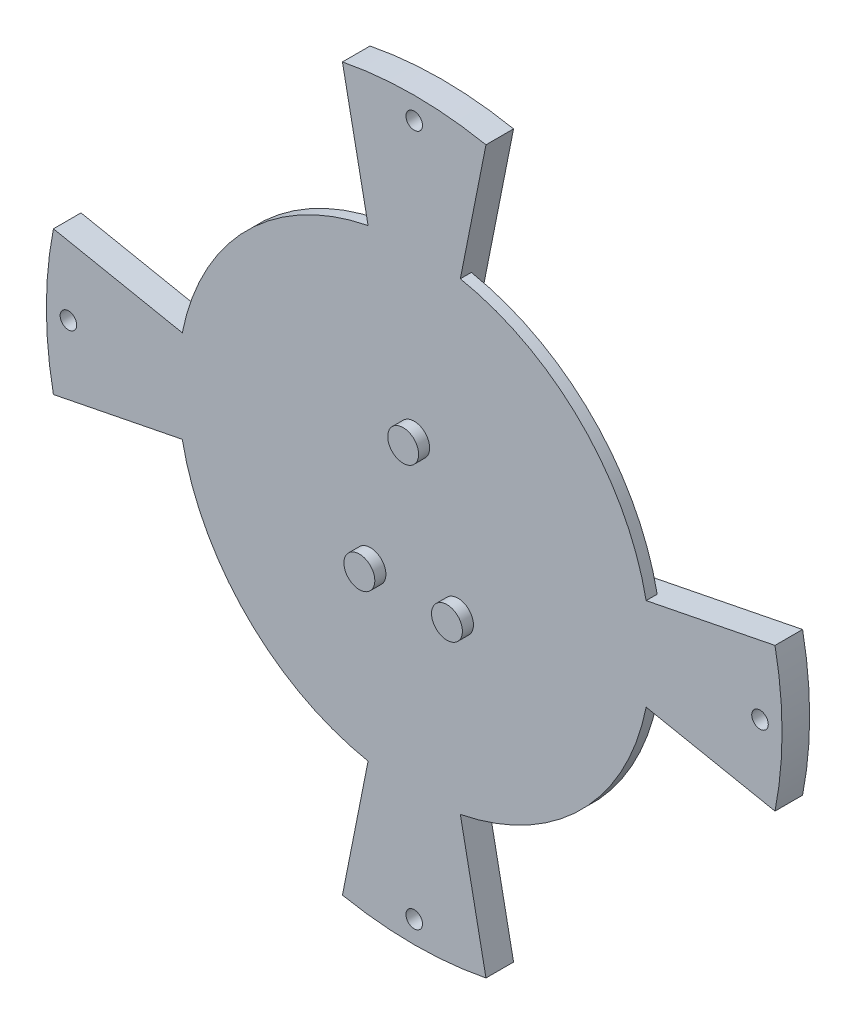
ISO-10303-21;
HEADER;
FILE_DESCRIPTION(('STEP AP214'),'2;1');
FILE_NAME('part.step','',(''),(''),'','','');
FILE_SCHEMA(('AUTOMOTIVE_DESIGN { 1 0 10303 214 1 1 1 1 }'));
ENDSEC;
DATA;
#1=APPLICATION_CONTEXT('core data for automotive mechanical design processes');
#2=APPLICATION_PROTOCOL_DEFINITION('international standard','automotive_design',2000,#1);
#3=PRODUCT_CONTEXT('',#1,'mechanical');
#4=PRODUCT('Part','Part','',(#3));
#5=PRODUCT_RELATED_PRODUCT_CATEGORY('part','',(#4));
#6=PRODUCT_DEFINITION_FORMATION('','',#4);
#7=PRODUCT_DEFINITION_CONTEXT('part definition',#1,'design');
#8=PRODUCT_DEFINITION('design','',#6,#7);
#9=PRODUCT_DEFINITION_SHAPE('','',#8);
#10=(LENGTH_UNIT() NAMED_UNIT(*) SI_UNIT(.MILLI.,.METRE.));
#11=(NAMED_UNIT(*) PLANE_ANGLE_UNIT() SI_UNIT($,.RADIAN.));
#12=(NAMED_UNIT(*) SI_UNIT($,.STERADIAN.) SOLID_ANGLE_UNIT());
#13=UNCERTAINTY_MEASURE_WITH_UNIT(LENGTH_MEASURE(1.E-05),#10,'distance_accuracy_value','');
#14=(GEOMETRIC_REPRESENTATION_CONTEXT(3) GLOBAL_UNCERTAINTY_ASSIGNED_CONTEXT((#13)) GLOBAL_UNIT_ASSIGNED_CONTEXT((#10,
#11,#12)) REPRESENTATION_CONTEXT('',''));
#15=CARTESIAN_POINT('',(0.,0.,0.));
#16=DIRECTION('',(0.,0.,1.));
#17=DIRECTION('',(1.,0.,0.));
#18=AXIS2_PLACEMENT_3D('',#15,#16,#17);
#19=CARTESIAN_POINT('',(0.,0.,5.));
#20=DIRECTION('',(0.,0.,-1.));
#21=DIRECTION('',(-1.,0.,0.));
#22=AXIS2_PLACEMENT_3D('',#19,#20,#21);
#23=CYLINDRICAL_SURFACE('',#22,25.);
#24=CARTESIAN_POINT('',(0.,0.,3.));
#25=DIRECTION('',(0.,0.,1.));
#26=DIRECTION('',(1.,0.,0.));
#27=AXIS2_PLACEMENT_3D('',#24,#25,#26);
#28=CIRCLE('',#27,25.);
#29=CARTESIAN_POINT('',(-4.87715672396995,24.5196521649438,3.));
#30=VERTEX_POINT('',#29);
#31=CARTESIAN_POINT('',(-24.5196521649438,4.87715672396992,3.));
#32=VERTEX_POINT('',#31);
#33=EDGE_CURVE('E436',#30,#32,#28,.T.);
#34=ORIENTED_EDGE('',*,*,#33,.F.);
#35=DIRECTION('',(0.,0.,-1.));
#36=VECTOR('',#35,1.);
#37=CARTESIAN_POINT('',(-4.87715672396995,24.5196521649438,5.));
#38=LINE('',#37,#36);
#39=CARTESIAN_POINT('',(-4.87715672396995,24.5196521649438,0.));
#40=VERTEX_POINT('',#39);
#41=EDGE_CURVE('E246',#30,#40,#38,.T.);
#42=ORIENTED_EDGE('',*,*,#41,.T.);
#43=CARTESIAN_POINT('',(0.,0.,0.));
#44=DIRECTION('',(0.,0.,1.));
#45=DIRECTION('',(1.,0.,0.));
#46=AXIS2_PLACEMENT_3D('',#43,#44,#45);
#47=CIRCLE('',#46,25.);
#48=CARTESIAN_POINT('',(-24.5196521649438,4.87715672396992,0.));
#49=VERTEX_POINT('',#48);
#50=EDGE_CURVE('E235',#40,#49,#47,.T.);
#51=ORIENTED_EDGE('',*,*,#50,.T.);
#52=DIRECTION('',(0.,0.,-1.));
#53=VECTOR('',#52,1.);
#54=CARTESIAN_POINT('',(-24.5196521649438,4.87715672396992,5.));
#55=LINE('',#54,#53);
#56=EDGE_CURVE('E279',#49,#32,#55,.F.);
#57=ORIENTED_EDGE('',*,*,#56,.T.);
#58=EDGE_LOOP('',(#34,#42,#51,#57));
#59=FACE_BOUND('',#58,.T.);
#60=ADVANCED_FACE('F31',(#59),#23,.T.);
#61=CARTESIAN_POINT('',(0.,0.,3.));
#62=DIRECTION('',(0.,0.,1.));
#63=DIRECTION('',(1.,0.,0.));
#64=AXIS2_PLACEMENT_3D('',#61,#62,#63);
#65=CIRCLE('',#64,25.);
#66=CARTESIAN_POINT('',(-24.5196521649438,-4.87715672396995,3.));
#67=VERTEX_POINT('',#66);
#68=CARTESIAN_POINT('',(-4.87715672396992,-24.5196521649438,3.));
#69=VERTEX_POINT('',#68);
#70=EDGE_CURVE('E483',#67,#69,#65,.T.);
#71=ORIENTED_EDGE('',*,*,#70,.F.);
#72=DIRECTION('',(0.,0.,-1.));
#73=VECTOR('',#72,1.);
#74=CARTESIAN_POINT('',(-24.5196521649438,-4.87715672396995,5.));
#75=LINE('',#74,#73);
#76=CARTESIAN_POINT('',(-24.5196521649438,-4.87715672396995,0.));
#77=VERTEX_POINT('',#76);
#78=EDGE_CURVE('E284',#67,#77,#75,.T.);
#79=ORIENTED_EDGE('',*,*,#78,.T.);
#80=CARTESIAN_POINT('',(-4.87715672396992,-24.5196521649438,0.));
#81=VERTEX_POINT('',#80);
#82=EDGE_CURVE('E444',#77,#81,#47,.T.);
#83=ORIENTED_EDGE('',*,*,#82,.T.);
#84=DIRECTION('',(0.,0.,-1.));
#85=VECTOR('',#84,1.);
#86=CARTESIAN_POINT('',(-4.87715672396992,-24.5196521649438,5.));
#87=LINE('',#86,#85);
#88=EDGE_CURVE('E311',#81,#69,#87,.F.);
#89=ORIENTED_EDGE('',*,*,#88,.T.);
#90=EDGE_LOOP('',(#71,#79,#83,#89));
#91=FACE_BOUND('',#90,.T.);
#92=ADVANCED_FACE('F429',(#91),#23,.T.);
#93=CARTESIAN_POINT('',(0.,0.,3.));
#94=DIRECTION('',(0.,0.,1.));
#95=DIRECTION('',(1.,0.,0.));
#96=AXIS2_PLACEMENT_3D('',#93,#94,#95);
#97=CIRCLE('',#96,25.);
#98=CARTESIAN_POINT('',(4.87715672396995,-24.5196521649438,3.));
#99=VERTEX_POINT('',#98);
#100=CARTESIAN_POINT('',(24.5196521649438,-4.87715672396992,3.));
#101=VERTEX_POINT('',#100);
#102=EDGE_CURVE('E386',#99,#101,#97,.T.);
#103=ORIENTED_EDGE('',*,*,#102,.F.);
#104=DIRECTION('',(0.,0.,-1.));
#105=VECTOR('',#104,1.);
#106=CARTESIAN_POINT('',(4.87715672396995,-24.5196521649438,5.));
#107=LINE('',#106,#105);
#108=CARTESIAN_POINT('',(4.87715672396995,-24.5196521649438,0.));
#109=VERTEX_POINT('',#108);
#110=EDGE_CURVE('E316',#99,#109,#107,.T.);
#111=ORIENTED_EDGE('',*,*,#110,.T.);
#112=CARTESIAN_POINT('',(24.5196521649438,-4.87715672396992,0.));
#113=VERTEX_POINT('',#112);
#114=EDGE_CURVE('E233',#109,#113,#47,.T.);
#115=ORIENTED_EDGE('',*,*,#114,.T.);
#116=DIRECTION('',(0.,0.,-1.));
#117=VECTOR('',#116,1.);
#118=CARTESIAN_POINT('',(24.5196521649438,-4.87715672396992,5.));
#119=LINE('',#118,#117);
#120=EDGE_CURVE('E225',#113,#101,#119,.F.);
#121=ORIENTED_EDGE('',*,*,#120,.T.);
#122=EDGE_LOOP('',(#103,#111,#115,#121));
#123=FACE_BOUND('',#122,.T.);
#124=ADVANCED_FACE('F426',(#123),#23,.T.);
#125=CARTESIAN_POINT('',(0.,0.,3.));
#126=DIRECTION('',(0.,0.,1.));
#127=DIRECTION('',(1.,0.,0.));
#128=AXIS2_PLACEMENT_3D('',#125,#126,#127);
#129=CIRCLE('',#128,25.);
#130=CARTESIAN_POINT('',(24.5196521649438,4.87715672396995,3.));
#131=VERTEX_POINT('',#130);
#132=CARTESIAN_POINT('',(4.87715672396992,24.5196521649438,3.));
#133=VERTEX_POINT('',#132);
#134=EDGE_CURVE('E244',#131,#133,#129,.T.);
#135=ORIENTED_EDGE('',*,*,#134,.F.);
#136=DIRECTION('',(0.,0.,-1.));
#137=VECTOR('',#136,1.);
#138=CARTESIAN_POINT('',(24.5196521649438,4.87715672396995,5.));
#139=LINE('',#138,#137);
#140=CARTESIAN_POINT('',(24.5196521649438,4.87715672396995,0.));
#141=VERTEX_POINT('',#140);
#142=EDGE_CURVE('E52',#131,#141,#139,.T.);
#143=ORIENTED_EDGE('',*,*,#142,.T.);
#144=CARTESIAN_POINT('',(4.87715672396992,24.5196521649438,0.));
#145=VERTEX_POINT('',#144);
#146=EDGE_CURVE('E234',#141,#145,#47,.T.);
#147=ORIENTED_EDGE('',*,*,#146,.T.);
#148=DIRECTION('',(0.,0.,-1.));
#149=VECTOR('',#148,1.);
#150=CARTESIAN_POINT('',(4.87715672396992,24.5196521649438,5.));
#151=LINE('',#150,#149);
#152=EDGE_CURVE('E240',#145,#133,#151,.F.);
#153=ORIENTED_EDGE('',*,*,#152,.T.);
#154=EDGE_LOOP('',(#135,#143,#147,#153));
#155=FACE_BOUND('',#154,.T.);
#156=ADVANCED_FACE('F243',(#155),#23,.T.);
#157=CARTESIAN_POINT('',(0.,0.,5.));
#158=DIRECTION('',(0.,0.,1.));
#159=DIRECTION('',(1.,0.,0.));
#160=AXIS2_PLACEMENT_3D('',#157,#158,#159);
#161=PLANE('',#160);
#162=DIRECTION('',(-0.980786086597753,-0.195086268958798,0.));
#163=VECTOR('',#162,1.);
#164=CARTESIAN_POINT('',(65.3939123239052,13.0073769828279,5.));
#165=LINE('',#164,#163);
#166=CARTESIAN_POINT('',(65.3939123239052,13.0073769828279,5.));
#167=VERTEX_POINT('',#166);
#168=CARTESIAN_POINT('',(42.0389436367962,8.36188520324647,5.));
#169=VERTEX_POINT('',#168);
#170=EDGE_CURVE('E205',#167,#169,#165,.T.);
#171=ORIENTED_EDGE('',*,*,#170,.T.);
#172=CARTESIAN_POINT('',(0.,0.,5.));
#173=DIRECTION('',(0.,0.,1.));
#174=DIRECTION('',(1.,0.,0.));
#175=AXIS2_PLACEMENT_3D('',#172,#173,#174);
#176=CIRCLE('',#175,42.8625);
#177=CARTESIAN_POINT('',(8.36188520324643,42.0389436367962,5.));
#178=VERTEX_POINT('',#177);
#179=EDGE_CURVE('E45',#169,#178,#176,.T.);
#180=ORIENTED_EDGE('',*,*,#179,.T.);
#181=DIRECTION('',(0.195086268958797,0.980786086597753,0.));
#182=VECTOR('',#181,1.);
#183=CARTESIAN_POINT('',(13.0073769828278,65.3939123239052,5.));
#184=LINE('',#183,#182);
#185=CARTESIAN_POINT('',(13.0073769828278,65.3939123239052,5.));
#186=VERTEX_POINT('',#185);
#187=EDGE_CURVE('E362',#178,#186,#184,.T.);
#188=ORIENTED_EDGE('',*,*,#187,.T.);
#189=CARTESIAN_POINT('',(0.,0.,5.));
#190=DIRECTION('',(0.,0.,1.));
#191=DIRECTION('',(-1.,0.,0.));
#192=AXIS2_PLACEMENT_3D('',#189,#190,#191);
#193=CIRCLE('',#192,66.675);
#194=CARTESIAN_POINT('',(-13.0073769828279,65.3939123239052,5.));
#195=VERTEX_POINT('',#194);
#196=EDGE_CURVE('E354',#186,#195,#193,.T.);
#197=ORIENTED_EDGE('',*,*,#196,.T.);
#198=DIRECTION('',(0.195086268958798,-0.980786086597753,0.));
#199=VECTOR('',#198,1.);
#200=CARTESIAN_POINT('',(-13.0073769828279,65.3939123239052,5.));
#201=LINE('',#200,#199);
#202=CARTESIAN_POINT('',(-8.36188520324648,42.0389436367962,5.));
#203=VERTEX_POINT('',#202);
#204=EDGE_CURVE('E349',#195,#203,#201,.T.);
#205=ORIENTED_EDGE('',*,*,#204,.T.);
#206=CARTESIAN_POINT('',(-42.0389436367962,8.36188520324643,5.));
#207=VERTEX_POINT('',#206);
#208=EDGE_CURVE('E198',#203,#207,#176,.T.);
#209=ORIENTED_EDGE('',*,*,#208,.T.);
#210=DIRECTION('',(-0.980786086597753,0.195086268958797,0.));
#211=VECTOR('',#210,1.);
#212=CARTESIAN_POINT('',(-65.3939123239052,13.0073769828278,5.));
#213=LINE('',#212,#211);
#214=CARTESIAN_POINT('',(-65.3939123239052,13.0073769828278,5.));
#215=VERTEX_POINT('',#214);
#216=EDGE_CURVE('E258',#207,#215,#213,.T.);
#217=ORIENTED_EDGE('',*,*,#216,.T.);
#218=CARTESIAN_POINT('',(0.,0.,5.));
#219=DIRECTION('',(0.,0.,1.));
#220=DIRECTION('',(-1.,0.,0.));
#221=AXIS2_PLACEMENT_3D('',#218,#219,#220);
#222=CIRCLE('',#221,66.675);
#223=CARTESIAN_POINT('',(-65.3939123239052,-13.0073769828279,5.));
#224=VERTEX_POINT('',#223);
#225=EDGE_CURVE('E272',#215,#224,#222,.T.);
#226=ORIENTED_EDGE('',*,*,#225,.T.);
#227=DIRECTION('',(0.980786086597753,0.195086268958798,0.));
#228=VECTOR('',#227,1.);
#229=CARTESIAN_POINT('',(-23.5388660783461,-4.68207045501115,5.));
#230=LINE('',#229,#228);
#231=CARTESIAN_POINT('',(-42.0389436367962,-8.36188520324647,5.));
#232=VERTEX_POINT('',#231);
#233=EDGE_CURVE('E264',#224,#232,#230,.T.);
#234=ORIENTED_EDGE('',*,*,#233,.T.);
#235=CARTESIAN_POINT('',(-8.36188520324643,-42.0389436367962,5.));
#236=VERTEX_POINT('',#235);
#237=EDGE_CURVE('E474',#232,#236,#176,.T.);
#238=ORIENTED_EDGE('',*,*,#237,.T.);
#239=DIRECTION('',(-0.195086268958797,-0.980786086597753,0.));
#240=VECTOR('',#239,1.);
#241=CARTESIAN_POINT('',(-13.0073769828278,-65.3939123239052,5.));
#242=LINE('',#241,#240);
#243=CARTESIAN_POINT('',(-13.0073769828277,-65.3939123239052,5.));
#244=VERTEX_POINT('',#243);
#245=EDGE_CURVE('E290',#236,#244,#242,.T.);
#246=ORIENTED_EDGE('',*,*,#245,.T.);
#247=CARTESIAN_POINT('',(0.,0.,5.));
#248=DIRECTION('',(0.,0.,1.));
#249=DIRECTION('',(-1.,0.,0.));
#250=AXIS2_PLACEMENT_3D('',#247,#248,#249);
#251=CIRCLE('',#250,66.675);
#252=CARTESIAN_POINT('',(13.0073769828279,-65.3939123239052,5.));
#253=VERTEX_POINT('',#252);
#254=EDGE_CURVE('E304',#244,#253,#251,.T.);
#255=ORIENTED_EDGE('',*,*,#254,.T.);
#256=DIRECTION('',(-0.195086268958798,0.980786086597753,0.));
#257=VECTOR('',#256,1.);
#258=CARTESIAN_POINT('',(4.68207045501116,-23.5388660783461,5.));
#259=LINE('',#258,#257);
#260=CARTESIAN_POINT('',(8.36188520324649,-42.0389436367962,5.));
#261=VERTEX_POINT('',#260);
#262=EDGE_CURVE('E296',#253,#261,#259,.T.);
#263=ORIENTED_EDGE('',*,*,#262,.T.);
#264=CARTESIAN_POINT('',(42.0389436367962,-8.36188520324643,5.));
#265=VERTEX_POINT('',#264);
#266=EDGE_CURVE('E200',#261,#265,#176,.T.);
#267=ORIENTED_EDGE('',*,*,#266,.T.);
#268=DIRECTION('',(0.980786086597753,-0.195086268958797,0.));
#269=VECTOR('',#268,1.);
#270=CARTESIAN_POINT('',(65.3939123239052,-13.0073769828278,5.));
#271=LINE('',#270,#269);
#272=CARTESIAN_POINT('',(65.3939123239052,-13.0073769828278,5.));
#273=VERTEX_POINT('',#272);
#274=EDGE_CURVE('E219',#265,#273,#271,.T.);
#275=ORIENTED_EDGE('',*,*,#274,.T.);
#276=CARTESIAN_POINT('',(0.,0.,5.));
#277=DIRECTION('',(0.,0.,1.));
#278=DIRECTION('',(-1.,0.,0.));
#279=AXIS2_PLACEMENT_3D('',#276,#277,#278);
#280=CIRCLE('',#279,66.675);
#281=EDGE_CURVE('E214',#273,#167,#280,.T.);
#282=ORIENTED_EDGE('',*,*,#281,.T.);
#283=EDGE_LOOP('',(#171,#180,#188,#197,#205,#209,#217,#226,#234,#238,#246,#255,#263,#267,#275,#282));
#284=FACE_BOUND('',#283,.T.);
#285=CARTESIAN_POINT('',(62.675,0.,5.));
#286=DIRECTION('',(0.,0.,1.));
#287=DIRECTION('',(1.,0.,0.));
#288=AXIS2_PLACEMENT_3D('',#285,#286,#287);
#289=CIRCLE('',#288,1.5);
#290=CARTESIAN_POINT('',(64.175,0.,5.));
#291=VERTEX_POINT('',#290);
#292=EDGE_CURVE('E318',#291,#291,#289,.T.);
#293=ORIENTED_EDGE('',*,*,#292,.F.);
#294=EDGE_LOOP('',(#293));
#295=FACE_BOUND('',#294,.T.);
#296=CARTESIAN_POINT('',(0.,12.7,5.));
#297=DIRECTION('',(0.,0.,1.));
#298=DIRECTION('',(1.,0.,0.));
#299=AXIS2_PLACEMENT_3D('',#296,#297,#298);
#300=CIRCLE('',#299,2.8);
#301=CARTESIAN_POINT('',(2.8,12.7,5.));
#302=VERTEX_POINT('',#301);
#303=EDGE_CURVE('E207',#302,#302,#300,.T.);
#304=ORIENTED_EDGE('',*,*,#303,.F.);
#305=EDGE_LOOP('',(#304));
#306=FACE_BOUND('',#305,.T.);
#307=CARTESIAN_POINT('',(-7.9375,-11.1125,5.));
#308=DIRECTION('',(0.,0.,1.));
#309=DIRECTION('',(1.,0.,0.));
#310=AXIS2_PLACEMENT_3D('',#307,#308,#309);
#311=CIRCLE('',#310,2.8);
#312=CARTESIAN_POINT('',(-5.1375,-11.1125,5.));
#313=VERTEX_POINT('',#312);
#314=EDGE_CURVE('E405',#313,#313,#311,.T.);
#315=ORIENTED_EDGE('',*,*,#314,.F.);
#316=EDGE_LOOP('',(#315));
#317=FACE_BOUND('',#316,.T.);
#318=CARTESIAN_POINT('',(7.9375,-11.1125,5.));
#319=DIRECTION('',(0.,0.,1.));
#320=DIRECTION('',(1.,0.,0.));
#321=AXIS2_PLACEMENT_3D('',#318,#319,#320);
#322=CIRCLE('',#321,2.8);
#323=CARTESIAN_POINT('',(10.7375,-11.1125,5.));
#324=VERTEX_POINT('',#323);
#325=EDGE_CURVE('E399',#324,#324,#322,.T.);
#326=ORIENTED_EDGE('',*,*,#325,.F.);
#327=EDGE_LOOP('',(#326));
#328=FACE_BOUND('',#327,.T.);
#329=CARTESIAN_POINT('',(0.,-62.675,5.));
#330=DIRECTION('',(0.,0.,1.));
#331=DIRECTION('',(1.,0.,0.));
#332=AXIS2_PLACEMENT_3D('',#329,#330,#331);
#333=CIRCLE('',#332,1.5);
#334=CARTESIAN_POINT('',(1.5,-62.675,5.));
#335=VERTEX_POINT('',#334);
#336=EDGE_CURVE('E286',#335,#335,#333,.T.);
#337=ORIENTED_EDGE('',*,*,#336,.F.);
#338=EDGE_LOOP('',(#337));
#339=FACE_BOUND('',#338,.T.);
#340=CARTESIAN_POINT('',(-62.675,0.,5.));
#341=DIRECTION('',(0.,0.,1.));
#342=DIRECTION('',(1.,0.,0.));
#343=AXIS2_PLACEMENT_3D('',#340,#341,#342);
#344=CIRCLE('',#343,1.5);
#345=CARTESIAN_POINT('',(-61.175,0.,5.));
#346=VERTEX_POINT('',#345);
#347=EDGE_CURVE('E249',#346,#346,#344,.T.);
#348=ORIENTED_EDGE('',*,*,#347,.F.);
#349=EDGE_LOOP('',(#348));
#350=FACE_BOUND('',#349,.T.);
#351=CARTESIAN_POINT('',(0.,62.675,5.));
#352=DIRECTION('',(0.,0.,1.));
#353=DIRECTION('',(1.,0.,0.));
#354=AXIS2_PLACEMENT_3D('',#351,#352,#353);
#355=CIRCLE('',#354,1.5);
#356=CARTESIAN_POINT('',(1.5,62.675,5.));
#357=VERTEX_POINT('',#356);
#358=EDGE_CURVE('E357',#357,#357,#355,.T.);
#359=ORIENTED_EDGE('',*,*,#358,.F.);
#360=EDGE_LOOP('',(#359));
#361=FACE_BOUND('',#360,.T.);
#362=ADVANCED_FACE('F211',(#284,#295,#306,#317,#328,#339,#350,#361),#161,.T.);
#363=CARTESIAN_POINT('',(0.,0.,0.));
#364=DIRECTION('',(0.,0.,1.));
#365=DIRECTION('',(1.,0.,0.));
#366=AXIS2_PLACEMENT_3D('',#363,#364,#365);
#367=PLANE('',#366);
#368=ORIENTED_EDGE('',*,*,#50,.F.);
#369=DIRECTION('',(0.195086268958798,-0.980786086597753,0.));
#370=VECTOR('',#369,1.);
#371=CARTESIAN_POINT('',(-13.0073769828279,65.3939123239052,0.));
#372=LINE('',#371,#370);
#373=CARTESIAN_POINT('',(-13.0073769828279,65.3939123239052,0.));
#374=VERTEX_POINT('',#373);
#375=EDGE_CURVE('E351',#374,#40,#372,.T.);
#376=ORIENTED_EDGE('',*,*,#375,.F.);
#377=CARTESIAN_POINT('',(0.,0.,0.));
#378=DIRECTION('',(0.,0.,1.));
#379=DIRECTION('',(-1.,0.,0.));
#380=AXIS2_PLACEMENT_3D('',#377,#378,#379);
#381=CIRCLE('',#380,66.675);
#382=CARTESIAN_POINT('',(13.0073769828278,65.3939123239052,0.));
#383=VERTEX_POINT('',#382);
#384=EDGE_CURVE('E346',#383,#374,#381,.T.);
#385=ORIENTED_EDGE('',*,*,#384,.F.);
#386=DIRECTION('',(0.195086268958797,0.980786086597753,0.));
#387=VECTOR('',#386,1.);
#388=CARTESIAN_POINT('',(13.0073769828278,65.3939123239052,0.));
#389=LINE('',#388,#387);
#390=EDGE_CURVE('E343',#145,#383,#389,.T.);
#391=ORIENTED_EDGE('',*,*,#390,.F.);
#392=ORIENTED_EDGE('',*,*,#146,.F.);
#393=DIRECTION('',(-0.980786086597753,-0.195086268958798,0.));
#394=VECTOR('',#393,1.);
#395=CARTESIAN_POINT('',(65.3939123239052,13.0073769828279,0.));
#396=LINE('',#395,#394);
#397=CARTESIAN_POINT('',(65.3939123239052,13.0073769828279,0.));
#398=VERTEX_POINT('',#397);
#399=EDGE_CURVE('E229',#398,#141,#396,.T.);
#400=ORIENTED_EDGE('',*,*,#399,.F.);
#401=CARTESIAN_POINT('',(0.,0.,0.));
#402=DIRECTION('',(0.,0.,1.));
#403=DIRECTION('',(-1.,0.,0.));
#404=AXIS2_PLACEMENT_3D('',#401,#402,#403);
#405=CIRCLE('',#404,66.675);
#406=CARTESIAN_POINT('',(65.3939123239052,-13.0073769828278,0.));
#407=VERTEX_POINT('',#406);
#408=EDGE_CURVE('E217',#407,#398,#405,.T.);
#409=ORIENTED_EDGE('',*,*,#408,.F.);
#410=DIRECTION('',(0.980786086597753,-0.195086268958797,0.));
#411=VECTOR('',#410,1.);
#412=CARTESIAN_POINT('',(65.3939123239052,-13.0073769828278,0.));
#413=LINE('',#412,#411);
#414=EDGE_CURVE('E215',#113,#407,#413,.T.);
#415=ORIENTED_EDGE('',*,*,#414,.F.);
#416=ORIENTED_EDGE('',*,*,#114,.F.);
#417=DIRECTION('',(-0.195086268958798,0.980786086597753,0.));
#418=VECTOR('',#417,1.);
#419=CARTESIAN_POINT('',(4.68207045501116,-23.5388660783461,0.));
#420=LINE('',#419,#418);
#421=CARTESIAN_POINT('',(13.0073769828279,-65.3939123239052,0.));
#422=VERTEX_POINT('',#421);
#423=EDGE_CURVE('E299',#422,#109,#420,.T.);
#424=ORIENTED_EDGE('',*,*,#423,.F.);
#425=CARTESIAN_POINT('',(0.,0.,0.));
#426=DIRECTION('',(0.,0.,1.));
#427=DIRECTION('',(-1.,0.,0.));
#428=AXIS2_PLACEMENT_3D('',#425,#426,#427);
#429=CIRCLE('',#428,66.675);
#430=CARTESIAN_POINT('',(-13.0073769828277,-65.3939123239052,0.));
#431=VERTEX_POINT('',#430);
#432=EDGE_CURVE('E295',#431,#422,#429,.T.);
#433=ORIENTED_EDGE('',*,*,#432,.F.);
#434=DIRECTION('',(-0.195086268958797,-0.980786086597753,0.));
#435=VECTOR('',#434,1.);
#436=CARTESIAN_POINT('',(-13.0073769828278,-65.3939123239052,0.));
#437=LINE('',#436,#435);
#438=EDGE_CURVE('E293',#81,#431,#437,.T.);
#439=ORIENTED_EDGE('',*,*,#438,.F.);
#440=ORIENTED_EDGE('',*,*,#82,.F.);
#441=DIRECTION('',(0.980786086597753,0.195086268958798,0.));
#442=VECTOR('',#441,1.);
#443=CARTESIAN_POINT('',(-23.5388660783461,-4.68207045501115,0.));
#444=LINE('',#443,#442);
#445=CARTESIAN_POINT('',(-65.3939123239052,-13.0073769828279,0.));
#446=VERTEX_POINT('',#445);
#447=EDGE_CURVE('E267',#446,#77,#444,.T.);
#448=ORIENTED_EDGE('',*,*,#447,.F.);
#449=CARTESIAN_POINT('',(0.,0.,0.));
#450=DIRECTION('',(0.,0.,1.));
#451=DIRECTION('',(-1.,0.,0.));
#452=AXIS2_PLACEMENT_3D('',#449,#450,#451);
#453=CIRCLE('',#452,66.675);
#454=CARTESIAN_POINT('',(-65.3939123239052,13.0073769828278,0.));
#455=VERTEX_POINT('',#454);
#456=EDGE_CURVE('E263',#455,#446,#453,.T.);
#457=ORIENTED_EDGE('',*,*,#456,.F.);
#458=DIRECTION('',(-0.980786086597753,0.195086268958797,0.));
#459=VECTOR('',#458,1.);
#460=CARTESIAN_POINT('',(-65.3939123239052,13.0073769828278,0.));
#461=LINE('',#460,#459);
#462=EDGE_CURVE('E261',#49,#455,#461,.T.);
#463=ORIENTED_EDGE('',*,*,#462,.F.);
#464=EDGE_LOOP('',(#368,#376,#385,#391,#392,#400,#409,#415,#416,#424,#433,#439,#440,#448,#457,#463));
#465=FACE_BOUND('',#464,.T.);
#466=CARTESIAN_POINT('',(62.675,0.,0.));
#467=DIRECTION('',(0.,0.,1.));
#468=DIRECTION('',(1.,0.,0.));
#469=AXIS2_PLACEMENT_3D('',#466,#467,#468);
#470=CIRCLE('',#469,1.5);
#471=CARTESIAN_POINT('',(64.175,0.,0.));
#472=VERTEX_POINT('',#471);
#473=EDGE_CURVE('E319',#472,#472,#470,.T.);
#474=ORIENTED_EDGE('',*,*,#473,.T.);
#475=EDGE_LOOP('',(#474));
#476=FACE_BOUND('',#475,.T.);
#477=CARTESIAN_POINT('',(0.,-62.675,0.));
#478=DIRECTION('',(0.,0.,1.));
#479=DIRECTION('',(1.,0.,0.));
#480=AXIS2_PLACEMENT_3D('',#477,#478,#479);
#481=CIRCLE('',#480,1.5);
#482=CARTESIAN_POINT('',(1.5,-62.675,0.));
#483=VERTEX_POINT('',#482);
#484=EDGE_CURVE('E287',#483,#483,#481,.T.);
#485=ORIENTED_EDGE('',*,*,#484,.T.);
#486=EDGE_LOOP('',(#485));
#487=FACE_BOUND('',#486,.T.);
#488=CARTESIAN_POINT('',(-62.675,0.,0.));
#489=DIRECTION('',(0.,0.,1.));
#490=DIRECTION('',(1.,0.,0.));
#491=AXIS2_PLACEMENT_3D('',#488,#489,#490);
#492=CIRCLE('',#491,1.5);
#493=CARTESIAN_POINT('',(-61.175,0.,0.));
#494=VERTEX_POINT('',#493);
#495=EDGE_CURVE('E255',#494,#494,#492,.T.);
#496=ORIENTED_EDGE('',*,*,#495,.T.);
#497=EDGE_LOOP('',(#496));
#498=FACE_BOUND('',#497,.T.);
#499=CARTESIAN_POINT('',(0.,62.675,0.));
#500=DIRECTION('',(0.,0.,1.));
#501=DIRECTION('',(1.,0.,0.));
#502=AXIS2_PLACEMENT_3D('',#499,#500,#501);
#503=CIRCLE('',#502,1.5);
#504=CARTESIAN_POINT('',(1.5,62.675,0.));
#505=VERTEX_POINT('',#504);
#506=EDGE_CURVE('E364',#505,#505,#503,.T.);
#507=ORIENTED_EDGE('',*,*,#506,.T.);
#508=EDGE_LOOP('',(#507));
#509=FACE_BOUND('',#508,.T.);
#510=ADVANCED_FACE('F340',(#465,#476,#487,#498,#509),#367,.F.);
#511=CARTESIAN_POINT('',(65.3939123239052,13.0073769828279,0.));
#512=DIRECTION('',(-0.195086268958798,0.980786086597753,0.));
#513=DIRECTION('',(-0.980786086597753,-0.195086268958798,0.));
#514=AXIS2_PLACEMENT_3D('',#511,#512,#513);
#515=PLANE('',#514);
#516=DIRECTION('',(0.,0.,1.));
#517=VECTOR('',#516,1.);
#518=CARTESIAN_POINT('',(42.0389436367962,8.36188520324647,3.));
#519=LINE('',#518,#517);
#520=CARTESIAN_POINT('',(42.0389436367962,8.36188520324647,3.));
#521=VERTEX_POINT('',#520);
#522=EDGE_CURVE('E193',#169,#521,#519,.F.);
#523=ORIENTED_EDGE('',*,*,#522,.F.);
#524=ORIENTED_EDGE('',*,*,#170,.F.);
#525=DIRECTION('',(0.,0.,1.));
#526=VECTOR('',#525,1.);
#527=CARTESIAN_POINT('',(65.3939123239052,13.0073769828279,0.));
#528=LINE('',#527,#526);
#529=EDGE_CURVE('E223',#398,#167,#528,.T.);
#530=ORIENTED_EDGE('',*,*,#529,.F.);
#531=ORIENTED_EDGE('',*,*,#399,.T.);
#532=ORIENTED_EDGE('',*,*,#142,.F.);
#533=DIRECTION('',(0.980786086597753,0.195086268958798,0.));
#534=VECTOR('',#533,1.);
#535=CARTESIAN_POINT('',(65.3939123239052,13.0073769828279,3.));
#536=LINE('',#535,#534);
#537=EDGE_CURVE('E206',#131,#521,#536,.T.);
#538=ORIENTED_EDGE('',*,*,#537,.T.);
#539=EDGE_LOOP('',(#523,#524,#530,#531,#532,#538));
#540=FACE_BOUND('',#539,.T.);
#541=ADVANCED_FACE('F204',(#540),#515,.T.);
#542=CARTESIAN_POINT('',(65.3939123239052,-13.0073769828278,0.));
#543=DIRECTION('',(-0.195086268958797,-0.980786086597753,0.));
#544=DIRECTION('',(0.980786086597753,-0.195086268958797,0.));
#545=AXIS2_PLACEMENT_3D('',#542,#543,#544);
#546=PLANE('',#545);
#547=DIRECTION('',(0.,0.,1.));
#548=VECTOR('',#547,1.);
#549=CARTESIAN_POINT('',(42.0389436367962,-8.36188520324643,3.));
#550=LINE('',#549,#548);
#551=CARTESIAN_POINT('',(42.0389436367962,-8.36188520324643,3.));
#552=VERTEX_POINT('',#551);
#553=EDGE_CURVE('E208',#552,#265,#550,.T.);
#554=ORIENTED_EDGE('',*,*,#553,.F.);
#555=DIRECTION('',(-0.980786086597753,0.195086268958797,0.));
#556=VECTOR('',#555,1.);
#557=CARTESIAN_POINT('',(65.3939123239052,-13.0073769828278,3.));
#558=LINE('',#557,#556);
#559=EDGE_CURVE('E381',#552,#101,#558,.T.);
#560=ORIENTED_EDGE('',*,*,#559,.T.);
#561=ORIENTED_EDGE('',*,*,#120,.F.);
#562=ORIENTED_EDGE('',*,*,#414,.T.);
#563=DIRECTION('',(0.,0.,1.));
#564=VECTOR('',#563,1.);
#565=CARTESIAN_POINT('',(65.3939123239052,-13.0073769828278,0.));
#566=LINE('',#565,#564);
#567=EDGE_CURVE('E226',#407,#273,#566,.T.);
#568=ORIENTED_EDGE('',*,*,#567,.T.);
#569=ORIENTED_EDGE('',*,*,#274,.F.);
#570=EDGE_LOOP('',(#554,#560,#561,#562,#568,#569));
#571=FACE_BOUND('',#570,.T.);
#572=ADVANCED_FACE('F331',(#571),#546,.T.);
#573=CARTESIAN_POINT('',(0.,0.,0.));
#574=DIRECTION('',(0.,0.,1.));
#575=DIRECTION('',(1.,0.,0.));
#576=AXIS2_PLACEMENT_3D('',#573,#574,#575);
#577=CYLINDRICAL_SURFACE('',#576,66.675);
#578=ORIENTED_EDGE('',*,*,#281,.F.);
#579=ORIENTED_EDGE('',*,*,#567,.F.);
#580=ORIENTED_EDGE('',*,*,#408,.T.);
#581=ORIENTED_EDGE('',*,*,#529,.T.);
#582=EDGE_LOOP('',(#578,#579,#580,#581));
#583=FACE_BOUND('',#582,.T.);
#584=ADVANCED_FACE('F336',(#583),#577,.T.);
#585=CARTESIAN_POINT('',(62.675,0.,0.));
#586=DIRECTION('',(0.,0.,1.));
#587=DIRECTION('',(1.,0.,0.));
#588=AXIS2_PLACEMENT_3D('',#585,#586,#587);
#589=CYLINDRICAL_SURFACE('',#588,1.5);
#590=ORIENTED_EDGE('',*,*,#473,.F.);
#591=EDGE_LOOP('',(#590));
#592=FACE_BOUND('',#591,.T.);
#593=ORIENTED_EDGE('',*,*,#292,.T.);
#594=EDGE_LOOP('',(#593));
#595=FACE_BOUND('',#594,.T.);
#596=ADVANCED_FACE('F529',(#592,#595),#589,.F.);
#597=CARTESIAN_POINT('',(4.68207045501116,-23.5388660783461,0.));
#598=DIRECTION('',(0.980786086597753,0.195086268958798,0.));
#599=DIRECTION('',(-0.195086268958798,0.980786086597753,0.));
#600=AXIS2_PLACEMENT_3D('',#597,#598,#599);
#601=PLANE('',#600);
#602=DIRECTION('',(0.,0.,1.));
#603=VECTOR('',#602,1.);
#604=CARTESIAN_POINT('',(8.36188520324649,-42.0389436367962,3.));
#605=LINE('',#604,#603);
#606=CARTESIAN_POINT('',(8.36188520324649,-42.0389436367962,3.));
#607=VERTEX_POINT('',#606);
#608=EDGE_CURVE('E393',#261,#607,#605,.F.);
#609=ORIENTED_EDGE('',*,*,#608,.F.);
#610=ORIENTED_EDGE('',*,*,#262,.F.);
#611=DIRECTION('',(0.,0.,1.));
#612=VECTOR('',#611,1.);
#613=CARTESIAN_POINT('',(13.0073769828279,-65.3939123239052,0.));
#614=LINE('',#613,#612);
#615=EDGE_CURVE('E309',#422,#253,#614,.T.);
#616=ORIENTED_EDGE('',*,*,#615,.F.);
#617=ORIENTED_EDGE('',*,*,#423,.T.);
#618=ORIENTED_EDGE('',*,*,#110,.F.);
#619=DIRECTION('',(0.195086268958798,-0.980786086597753,0.));
#620=VECTOR('',#619,1.);
#621=CARTESIAN_POINT('',(4.68207045501116,-23.5388660783461,3.));
#622=LINE('',#621,#620);
#623=EDGE_CURVE('E488',#99,#607,#622,.T.);
#624=ORIENTED_EDGE('',*,*,#623,.T.);
#625=EDGE_LOOP('',(#609,#610,#616,#617,#618,#624));
#626=FACE_BOUND('',#625,.T.);
#627=ADVANCED_FACE('F490',(#626),#601,.T.);
#628=CARTESIAN_POINT('',(-13.0073769828278,-65.3939123239052,0.));
#629=DIRECTION('',(-0.980786086597753,0.195086268958797,0.));
#630=DIRECTION('',(-0.195086268958797,-0.980786086597754,0.));
#631=AXIS2_PLACEMENT_3D('',#628,#629,#630);
#632=PLANE('',#631);
#633=DIRECTION('',(0.,0.,1.));
#634=VECTOR('',#633,1.);
#635=CARTESIAN_POINT('',(-8.36188520324643,-42.0389436367962,3.));
#636=LINE('',#635,#634);
#637=CARTESIAN_POINT('',(-8.36188520324643,-42.0389436367962,3.));
#638=VERTEX_POINT('',#637);
#639=EDGE_CURVE('E391',#638,#236,#636,.T.);
#640=ORIENTED_EDGE('',*,*,#639,.F.);
#641=DIRECTION('',(0.195086268958797,0.980786086597754,0.));
#642=VECTOR('',#641,1.);
#643=CARTESIAN_POINT('',(-13.0073769828278,-65.3939123239052,3.));
#644=LINE('',#643,#642);
#645=EDGE_CURVE('E485',#638,#69,#644,.T.);
#646=ORIENTED_EDGE('',*,*,#645,.T.);
#647=ORIENTED_EDGE('',*,*,#88,.F.);
#648=ORIENTED_EDGE('',*,*,#438,.T.);
#649=DIRECTION('',(0.,0.,1.));
#650=VECTOR('',#649,1.);
#651=CARTESIAN_POINT('',(-13.0073769828277,-65.3939123239052,0.));
#652=LINE('',#651,#650);
#653=EDGE_CURVE('E302',#431,#244,#652,.T.);
#654=ORIENTED_EDGE('',*,*,#653,.T.);
#655=ORIENTED_EDGE('',*,*,#245,.F.);
#656=EDGE_LOOP('',(#640,#646,#647,#648,#654,#655));
#657=FACE_BOUND('',#656,.T.);
#658=ADVANCED_FACE('F501',(#657),#632,.T.);
#659=CARTESIAN_POINT('',(0.,0.,0.));
#660=DIRECTION('',(0.,0.,1.));
#661=DIRECTION('',(1.,0.,0.));
#662=AXIS2_PLACEMENT_3D('',#659,#660,#661);
#663=CYLINDRICAL_SURFACE('',#662,66.675);
#664=ORIENTED_EDGE('',*,*,#254,.F.);
#665=ORIENTED_EDGE('',*,*,#653,.F.);
#666=ORIENTED_EDGE('',*,*,#432,.T.);
#667=ORIENTED_EDGE('',*,*,#615,.T.);
#668=EDGE_LOOP('',(#664,#665,#666,#667));
#669=FACE_BOUND('',#668,.T.);
#670=ADVANCED_FACE('F497',(#669),#663,.T.);
#671=CARTESIAN_POINT('',(0.,-62.675,0.));
#672=DIRECTION('',(0.,0.,1.));
#673=DIRECTION('',(1.,0.,0.));
#674=AXIS2_PLACEMENT_3D('',#671,#672,#673);
#675=CYLINDRICAL_SURFACE('',#674,1.5);
#676=ORIENTED_EDGE('',*,*,#484,.F.);
#677=EDGE_LOOP('',(#676));
#678=FACE_BOUND('',#677,.T.);
#679=ORIENTED_EDGE('',*,*,#336,.T.);
#680=EDGE_LOOP('',(#679));
#681=FACE_BOUND('',#680,.T.);
#682=ADVANCED_FACE('F523',(#678,#681),#675,.F.);
#683=CARTESIAN_POINT('',(-23.5388660783461,-4.68207045501115,0.));
#684=DIRECTION('',(0.195086268958798,-0.980786086597753,0.));
#685=DIRECTION('',(0.980786086597753,0.195086268958798,0.));
#686=AXIS2_PLACEMENT_3D('',#683,#684,#685);
#687=PLANE('',#686);
#688=DIRECTION('',(0.,0.,1.));
#689=VECTOR('',#688,1.);
#690=CARTESIAN_POINT('',(-42.0389436367962,-8.36188520324647,3.));
#691=LINE('',#690,#689);
#692=CARTESIAN_POINT('',(-42.0389436367962,-8.36188520324647,3.));
#693=VERTEX_POINT('',#692);
#694=EDGE_CURVE('E383',#232,#693,#691,.F.);
#695=ORIENTED_EDGE('',*,*,#694,.F.);
#696=ORIENTED_EDGE('',*,*,#233,.F.);
#697=DIRECTION('',(0.,0.,1.));
#698=VECTOR('',#697,1.);
#699=CARTESIAN_POINT('',(-65.3939123239052,-13.0073769828279,0.));
#700=LINE('',#699,#698);
#701=EDGE_CURVE('E277',#446,#224,#700,.T.);
#702=ORIENTED_EDGE('',*,*,#701,.F.);
#703=ORIENTED_EDGE('',*,*,#447,.T.);
#704=ORIENTED_EDGE('',*,*,#78,.F.);
#705=DIRECTION('',(-0.980786086597753,-0.195086268958798,0.));
#706=VECTOR('',#705,1.);
#707=CARTESIAN_POINT('',(-23.5388660783461,-4.68207045501115,3.));
#708=LINE('',#707,#706);
#709=EDGE_CURVE('E480',#67,#693,#708,.T.);
#710=ORIENTED_EDGE('',*,*,#709,.T.);
#711=EDGE_LOOP('',(#695,#696,#702,#703,#704,#710));
#712=FACE_BOUND('',#711,.T.);
#713=ADVANCED_FACE('F507',(#712),#687,.T.);
#714=CARTESIAN_POINT('',(-65.3939123239052,13.0073769828278,0.));
#715=DIRECTION('',(0.195086268958797,0.980786086597753,0.));
#716=DIRECTION('',(-0.980786086597753,0.195086268958797,0.));
#717=AXIS2_PLACEMENT_3D('',#714,#715,#716);
#718=PLANE('',#717);
#719=DIRECTION('',(0.,0.,1.));
#720=VECTOR('',#719,1.);
#721=CARTESIAN_POINT('',(-42.0389436367962,8.36188520324643,3.));
#722=LINE('',#721,#720);
#723=CARTESIAN_POINT('',(-42.0389436367962,8.36188520324643,3.));
#724=VERTEX_POINT('',#723);
#725=EDGE_CURVE('E380',#724,#207,#722,.T.);
#726=ORIENTED_EDGE('',*,*,#725,.F.);
#727=DIRECTION('',(0.980786086597753,-0.195086268958797,0.));
#728=VECTOR('',#727,1.);
#729=CARTESIAN_POINT('',(-65.3939123239052,13.0073769828278,3.));
#730=LINE('',#729,#728);
#731=EDGE_CURVE('E440',#724,#32,#730,.T.);
#732=ORIENTED_EDGE('',*,*,#731,.T.);
#733=ORIENTED_EDGE('',*,*,#56,.F.);
#734=ORIENTED_EDGE('',*,*,#462,.T.);
#735=DIRECTION('',(0.,0.,1.));
#736=VECTOR('',#735,1.);
#737=CARTESIAN_POINT('',(-65.3939123239052,13.0073769828278,0.));
#738=LINE('',#737,#736);
#739=EDGE_CURVE('E270',#455,#215,#738,.T.);
#740=ORIENTED_EDGE('',*,*,#739,.T.);
#741=ORIENTED_EDGE('',*,*,#216,.F.);
#742=EDGE_LOOP('',(#726,#732,#733,#734,#740,#741));
#743=FACE_BOUND('',#742,.T.);
#744=ADVANCED_FACE('F470',(#743),#718,.T.);
#745=CARTESIAN_POINT('',(0.,0.,0.));
#746=DIRECTION('',(0.,0.,1.));
#747=DIRECTION('',(1.,0.,0.));
#748=AXIS2_PLACEMENT_3D('',#745,#746,#747);
#749=CYLINDRICAL_SURFACE('',#748,66.675);
#750=ORIENTED_EDGE('',*,*,#225,.F.);
#751=ORIENTED_EDGE('',*,*,#739,.F.);
#752=ORIENTED_EDGE('',*,*,#456,.T.);
#753=ORIENTED_EDGE('',*,*,#701,.T.);
#754=EDGE_LOOP('',(#750,#751,#752,#753));
#755=FACE_BOUND('',#754,.T.);
#756=ADVANCED_FACE('F510',(#755),#749,.T.);
#757=CARTESIAN_POINT('',(-62.675,0.,0.));
#758=DIRECTION('',(0.,0.,1.));
#759=DIRECTION('',(1.,0.,0.));
#760=AXIS2_PLACEMENT_3D('',#757,#758,#759);
#761=CYLINDRICAL_SURFACE('',#760,1.5);
#762=ORIENTED_EDGE('',*,*,#495,.F.);
#763=EDGE_LOOP('',(#762));
#764=FACE_BOUND('',#763,.T.);
#765=ORIENTED_EDGE('',*,*,#347,.T.);
#766=EDGE_LOOP('',(#765));
#767=FACE_BOUND('',#766,.T.);
#768=ADVANCED_FACE('F512',(#764,#767),#761,.F.);
#769=CARTESIAN_POINT('',(-13.0073769828279,65.3939123239052,0.));
#770=DIRECTION('',(-0.980786086597753,-0.195086268958798,0.));
#771=DIRECTION('',(0.195086268958798,-0.980786086597753,0.));
#772=AXIS2_PLACEMENT_3D('',#769,#770,#771);
#773=PLANE('',#772);
#774=DIRECTION('',(0.,0.,1.));
#775=VECTOR('',#774,1.);
#776=CARTESIAN_POINT('',(-8.36188520324648,42.0389436367962,3.));
#777=LINE('',#776,#775);
#778=CARTESIAN_POINT('',(-8.36188520324648,42.0389436367962,3.));
#779=VERTEX_POINT('',#778);
#780=EDGE_CURVE('E374',#203,#779,#777,.F.);
#781=ORIENTED_EDGE('',*,*,#780,.F.);
#782=ORIENTED_EDGE('',*,*,#204,.F.);
#783=DIRECTION('',(0.,0.,1.));
#784=VECTOR('',#783,1.);
#785=CARTESIAN_POINT('',(-13.0073769828279,65.3939123239052,0.));
#786=LINE('',#785,#784);
#787=EDGE_CURVE('E247',#374,#195,#786,.T.);
#788=ORIENTED_EDGE('',*,*,#787,.F.);
#789=ORIENTED_EDGE('',*,*,#375,.T.);
#790=ORIENTED_EDGE('',*,*,#41,.F.);
#791=DIRECTION('',(-0.195086268958798,0.980786086597753,0.));
#792=VECTOR('',#791,1.);
#793=CARTESIAN_POINT('',(-13.0073769828279,65.3939123239052,3.));
#794=LINE('',#793,#792);
#795=EDGE_CURVE('E376',#30,#779,#794,.T.);
#796=ORIENTED_EDGE('',*,*,#795,.T.);
#797=EDGE_LOOP('',(#781,#782,#788,#789,#790,#796));
#798=FACE_BOUND('',#797,.T.);
#799=ADVANCED_FACE('F372',(#798),#773,.T.);
#800=CARTESIAN_POINT('',(13.0073769828278,65.3939123239052,0.));
#801=DIRECTION('',(0.980786086597753,-0.195086268958797,0.));
#802=DIRECTION('',(0.195086268958797,0.980786086597754,0.));
#803=AXIS2_PLACEMENT_3D('',#800,#801,#802);
#804=PLANE('',#803);
#805=DIRECTION('',(0.,0.,1.));
#806=VECTOR('',#805,1.);
#807=CARTESIAN_POINT('',(8.36188520324643,42.0389436367962,3.));
#808=LINE('',#807,#806);
#809=CARTESIAN_POINT('',(8.36188520324643,42.0389436367962,3.));
#810=VERTEX_POINT('',#809);
#811=EDGE_CURVE('E11',#810,#178,#808,.T.);
#812=ORIENTED_EDGE('',*,*,#811,.F.);
#813=DIRECTION('',(-0.195086268958797,-0.980786086597754,0.));
#814=VECTOR('',#813,1.);
#815=CARTESIAN_POINT('',(13.0073769828278,65.3939123239052,3.));
#816=LINE('',#815,#814);
#817=EDGE_CURVE('E38',#810,#133,#816,.T.);
#818=ORIENTED_EDGE('',*,*,#817,.T.);
#819=ORIENTED_EDGE('',*,*,#152,.F.);
#820=ORIENTED_EDGE('',*,*,#390,.T.);
#821=DIRECTION('',(0.,0.,1.));
#822=VECTOR('',#821,1.);
#823=CARTESIAN_POINT('',(13.0073769828278,65.3939123239052,0.));
#824=LINE('',#823,#822);
#825=EDGE_CURVE('E251',#383,#186,#824,.T.);
#826=ORIENTED_EDGE('',*,*,#825,.T.);
#827=ORIENTED_EDGE('',*,*,#187,.F.);
#828=EDGE_LOOP('',(#812,#818,#819,#820,#826,#827));
#829=FACE_BOUND('',#828,.T.);
#830=ADVANCED_FACE('F239',(#829),#804,.T.);
#831=CARTESIAN_POINT('',(0.,0.,0.));
#832=DIRECTION('',(0.,0.,1.));
#833=DIRECTION('',(1.,0.,0.));
#834=AXIS2_PLACEMENT_3D('',#831,#832,#833);
#835=CYLINDRICAL_SURFACE('',#834,66.675);
#836=ORIENTED_EDGE('',*,*,#196,.F.);
#837=ORIENTED_EDGE('',*,*,#825,.F.);
#838=ORIENTED_EDGE('',*,*,#384,.T.);
#839=ORIENTED_EDGE('',*,*,#787,.T.);
#840=EDGE_LOOP('',(#836,#837,#838,#839));
#841=FACE_BOUND('',#840,.T.);
#842=ADVANCED_FACE('F598',(#841),#835,.T.);
#843=CARTESIAN_POINT('',(0.,62.675,0.));
#844=DIRECTION('',(0.,0.,1.));
#845=DIRECTION('',(1.,0.,0.));
#846=AXIS2_PLACEMENT_3D('',#843,#844,#845);
#847=CYLINDRICAL_SURFACE('',#846,1.5);
#848=ORIENTED_EDGE('',*,*,#506,.F.);
#849=EDGE_LOOP('',(#848));
#850=FACE_BOUND('',#849,.T.);
#851=ORIENTED_EDGE('',*,*,#358,.T.);
#852=EDGE_LOOP('',(#851));
#853=FACE_BOUND('',#852,.T.);
#854=ADVANCED_FACE('F418',(#850,#853),#847,.F.);
#855=CARTESIAN_POINT('',(-7.9375,-11.1125,7.));
#856=DIRECTION('',(0.,0.,-1.));
#857=DIRECTION('',(-1.,0.,0.));
#858=AXIS2_PLACEMENT_3D('',#855,#856,#857);
#859=CYLINDRICAL_SURFACE('',#858,2.8);
#860=CARTESIAN_POINT('',(-7.9375,-11.1125,7.));
#861=DIRECTION('',(0.,0.,1.));
#862=DIRECTION('',(1.,0.,0.));
#863=AXIS2_PLACEMENT_3D('',#860,#861,#862);
#864=CIRCLE('',#863,2.8);
#865=CARTESIAN_POINT('',(-5.1375,-11.1125,7.));
#866=VERTEX_POINT('',#865);
#867=EDGE_CURVE('E408',#866,#866,#864,.T.);
#868=ORIENTED_EDGE('',*,*,#867,.F.);
#869=EDGE_LOOP('',(#868));
#870=FACE_BOUND('',#869,.T.);
#871=ORIENTED_EDGE('',*,*,#314,.T.);
#872=EDGE_LOOP('',(#871));
#873=FACE_BOUND('',#872,.T.);
#874=ADVANCED_FACE('F688',(#870,#873),#859,.T.);
#875=CARTESIAN_POINT('',(-7.9375,-11.1125,7.));
#876=DIRECTION('',(0.,0.,1.));
#877=DIRECTION('',(1.,0.,0.));
#878=AXIS2_PLACEMENT_3D('',#875,#876,#877);
#879=PLANE('',#878);
#880=ORIENTED_EDGE('',*,*,#867,.T.);
#881=EDGE_LOOP('',(#880));
#882=FACE_BOUND('',#881,.T.);
#883=ADVANCED_FACE('F684',(#882),#879,.T.);
#884=CARTESIAN_POINT('',(7.9375,-11.1125,7.));
#885=DIRECTION('',(0.,0.,-1.));
#886=DIRECTION('',(-1.,0.,0.));
#887=AXIS2_PLACEMENT_3D('',#884,#885,#886);
#888=CYLINDRICAL_SURFACE('',#887,2.8);
#889=CARTESIAN_POINT('',(7.9375,-11.1125,7.));
#890=DIRECTION('',(0.,0.,1.));
#891=DIRECTION('',(1.,0.,0.));
#892=AXIS2_PLACEMENT_3D('',#889,#890,#891);
#893=CIRCLE('',#892,2.8);
#894=CARTESIAN_POINT('',(10.7375,-11.1125,7.));
#895=VERTEX_POINT('',#894);
#896=EDGE_CURVE('E402',#895,#895,#893,.T.);
#897=ORIENTED_EDGE('',*,*,#896,.F.);
#898=EDGE_LOOP('',(#897));
#899=FACE_BOUND('',#898,.T.);
#900=ORIENTED_EDGE('',*,*,#325,.T.);
#901=EDGE_LOOP('',(#900));
#902=FACE_BOUND('',#901,.T.);
#903=ADVANCED_FACE('F680',(#899,#902),#888,.T.);
#904=CARTESIAN_POINT('',(7.9375,-11.1125,7.));
#905=DIRECTION('',(0.,0.,1.));
#906=DIRECTION('',(1.,0.,0.));
#907=AXIS2_PLACEMENT_3D('',#904,#905,#906);
#908=PLANE('',#907);
#909=ORIENTED_EDGE('',*,*,#896,.T.);
#910=EDGE_LOOP('',(#909));
#911=FACE_BOUND('',#910,.T.);
#912=ADVANCED_FACE('F676',(#911),#908,.T.);
#913=CARTESIAN_POINT('',(0.,12.7,7.));
#914=DIRECTION('',(0.,0.,-1.));
#915=DIRECTION('',(-1.,0.,0.));
#916=AXIS2_PLACEMENT_3D('',#913,#914,#915);
#917=CYLINDRICAL_SURFACE('',#916,2.8);
#918=CARTESIAN_POINT('',(0.,12.7,7.));
#919=DIRECTION('',(0.,0.,1.));
#920=DIRECTION('',(1.,0.,0.));
#921=AXIS2_PLACEMENT_3D('',#918,#919,#920);
#922=CIRCLE('',#921,2.8);
#923=CARTESIAN_POINT('',(2.8,12.7,7.));
#924=VERTEX_POINT('',#923);
#925=EDGE_CURVE('E396',#924,#924,#922,.T.);
#926=ORIENTED_EDGE('',*,*,#925,.F.);
#927=EDGE_LOOP('',(#926));
#928=FACE_BOUND('',#927,.T.);
#929=ORIENTED_EDGE('',*,*,#303,.T.);
#930=EDGE_LOOP('',(#929));
#931=FACE_BOUND('',#930,.T.);
#932=ADVANCED_FACE('F672',(#928,#931),#917,.T.);
#933=CARTESIAN_POINT('',(0.,12.7,7.));
#934=DIRECTION('',(0.,0.,1.));
#935=DIRECTION('',(1.,0.,0.));
#936=AXIS2_PLACEMENT_3D('',#933,#934,#935);
#937=PLANE('',#936);
#938=ORIENTED_EDGE('',*,*,#925,.T.);
#939=EDGE_LOOP('',(#938));
#940=FACE_BOUND('',#939,.T.);
#941=ADVANCED_FACE('F610',(#940),#937,.T.);
#942=CARTESIAN_POINT('',(0.,0.,3.));
#943=DIRECTION('',(0.,0.,1.));
#944=DIRECTION('',(1.,0.,0.));
#945=AXIS2_PLACEMENT_3D('',#942,#943,#944);
#946=PLANE('',#945);
#947=ORIENTED_EDGE('',*,*,#537,.F.);
#948=ORIENTED_EDGE('',*,*,#134,.T.);
#949=ORIENTED_EDGE('',*,*,#817,.F.);
#950=CARTESIAN_POINT('',(0.,0.,3.));
#951=DIRECTION('',(0.,0.,1.));
#952=DIRECTION('',(1.,0.,0.));
#953=AXIS2_PLACEMENT_3D('',#950,#951,#952);
#954=CIRCLE('',#953,42.8625);
#955=EDGE_CURVE('E462',#521,#810,#954,.T.);
#956=ORIENTED_EDGE('',*,*,#955,.F.);
#957=EDGE_LOOP('',(#947,#948,#949,#956));
#958=FACE_BOUND('',#957,.T.);
#959=ADVANCED_FACE('F605',(#958),#946,.F.);
#960=CARTESIAN_POINT('',(0.,0.,3.));
#961=DIRECTION('',(0.,0.,1.));
#962=DIRECTION('',(1.,0.,0.));
#963=AXIS2_PLACEMENT_3D('',#960,#961,#962);
#964=CYLINDRICAL_SURFACE('',#963,42.8625);
#965=ORIENTED_EDGE('',*,*,#179,.F.);
#966=ORIENTED_EDGE('',*,*,#522,.T.);
#967=ORIENTED_EDGE('',*,*,#955,.T.);
#968=ORIENTED_EDGE('',*,*,#811,.T.);
#969=EDGE_LOOP('',(#965,#966,#967,#968));
#970=FACE_BOUND('',#969,.T.);
#971=ADVANCED_FACE('F191',(#970),#964,.T.);
#972=ORIENTED_EDGE('',*,*,#731,.F.);
#973=EDGE_CURVE('E464',#779,#724,#954,.T.);
#974=ORIENTED_EDGE('',*,*,#973,.F.);
#975=ORIENTED_EDGE('',*,*,#795,.F.);
#976=ORIENTED_EDGE('',*,*,#33,.T.);
#977=EDGE_LOOP('',(#972,#974,#975,#976));
#978=FACE_BOUND('',#977,.T.);
#979=ADVANCED_FACE('F612',(#978),#946,.F.);
#980=ORIENTED_EDGE('',*,*,#973,.T.);
#981=ORIENTED_EDGE('',*,*,#725,.T.);
#982=ORIENTED_EDGE('',*,*,#208,.F.);
#983=ORIENTED_EDGE('',*,*,#780,.T.);
#984=EDGE_LOOP('',(#980,#981,#982,#983));
#985=FACE_BOUND('',#984,.T.);
#986=ADVANCED_FACE('F467',(#985),#964,.T.);
#987=ORIENTED_EDGE('',*,*,#645,.F.);
#988=EDGE_CURVE('E460',#693,#638,#954,.T.);
#989=ORIENTED_EDGE('',*,*,#988,.F.);
#990=ORIENTED_EDGE('',*,*,#709,.F.);
#991=ORIENTED_EDGE('',*,*,#70,.T.);
#992=EDGE_LOOP('',(#987,#989,#990,#991));
#993=FACE_BOUND('',#992,.T.);
#994=ADVANCED_FACE('F630',(#993),#946,.F.);
#995=ORIENTED_EDGE('',*,*,#988,.T.);
#996=ORIENTED_EDGE('',*,*,#639,.T.);
#997=ORIENTED_EDGE('',*,*,#237,.F.);
#998=ORIENTED_EDGE('',*,*,#694,.T.);
#999=EDGE_LOOP('',(#995,#996,#997,#998));
#1000=FACE_BOUND('',#999,.T.);
#1001=ADVANCED_FACE('F638',(#1000),#964,.T.);
#1002=EDGE_CURVE('E197',#607,#552,#954,.T.);
#1003=ORIENTED_EDGE('',*,*,#1002,.T.);
#1004=ORIENTED_EDGE('',*,*,#553,.T.);
#1005=ORIENTED_EDGE('',*,*,#266,.F.);
#1006=ORIENTED_EDGE('',*,*,#608,.T.);
#1007=EDGE_LOOP('',(#1003,#1004,#1005,#1006));
#1008=FACE_BOUND('',#1007,.T.);
#1009=ADVANCED_FACE('F458',(#1008),#964,.T.);
#1010=ORIENTED_EDGE('',*,*,#559,.F.);
#1011=ORIENTED_EDGE('',*,*,#1002,.F.);
#1012=ORIENTED_EDGE('',*,*,#623,.F.);
#1013=ORIENTED_EDGE('',*,*,#102,.T.);
#1014=EDGE_LOOP('',(#1010,#1011,#1012,#1013));
#1015=FACE_BOUND('',#1014,.T.);
#1016=ADVANCED_FACE('F455',(#1015),#946,.F.);
#1017=CLOSED_SHELL('',(#60,#92,#124,#156,#362,#510,#541,#572,#584,#596,#627,#658,#670,#682,#713,
#744,#756,#768,#799,#830,#842,#854,#874,#883,#903,#912,#932,#941,#959,#971,#979,#986,#994,#1001,
#1009,#1016));
#1018=MANIFOLD_SOLID_BREP('B2',#1017);
#1019=ADVANCED_BREP_SHAPE_REPRESENTATION('',(#18,#1018),#14);
#1020=SHAPE_DEFINITION_REPRESENTATION(#9,#1019);
ENDSEC;
END-ISO-10303-21;
